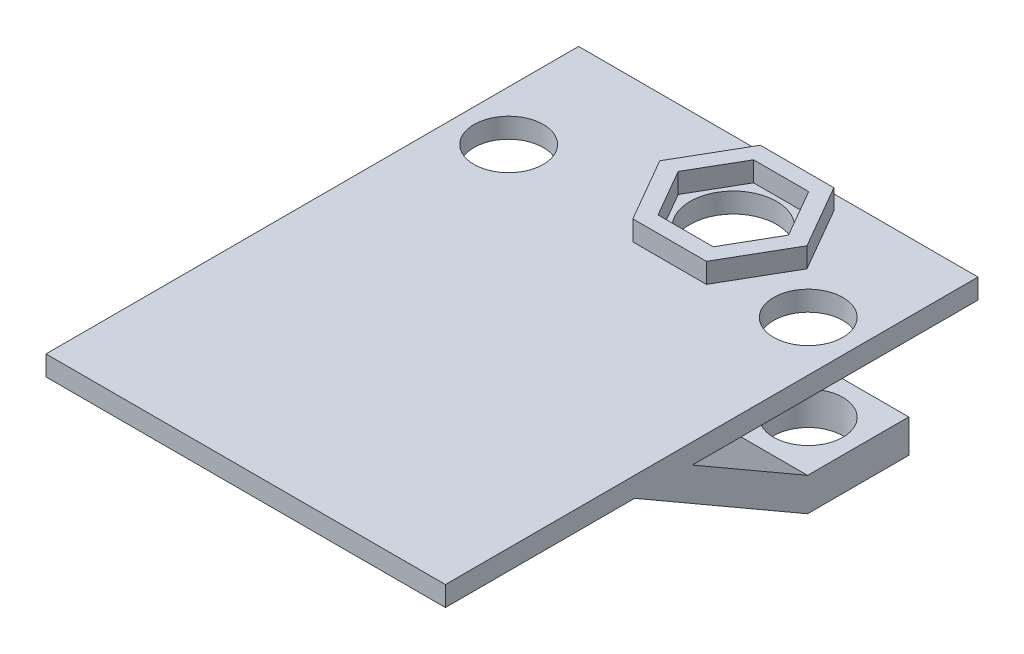
ISO-10303-21;
HEADER;
FILE_DESCRIPTION(('STEP AP214'),'2;1');
FILE_NAME('part.step','',(''),(''),'','','');
FILE_SCHEMA(('AUTOMOTIVE_DESIGN { 1 0 10303 214 1 1 1 1 }'));
ENDSEC;
DATA;
#1=APPLICATION_CONTEXT('core data for automotive mechanical design processes');
#2=APPLICATION_PROTOCOL_DEFINITION('international standard','automotive_design',2000,#1);
#3=PRODUCT_CONTEXT('',#1,'mechanical');
#4=PRODUCT('Part','Part','',(#3));
#5=PRODUCT_RELATED_PRODUCT_CATEGORY('part','',(#4));
#6=PRODUCT_DEFINITION_FORMATION('','',#4);
#7=PRODUCT_DEFINITION_CONTEXT('part definition',#1,'design');
#8=PRODUCT_DEFINITION('design','',#6,#7);
#9=PRODUCT_DEFINITION_SHAPE('','',#8);
#10=(LENGTH_UNIT() NAMED_UNIT(*) SI_UNIT(.MILLI.,.METRE.));
#11=(NAMED_UNIT(*) PLANE_ANGLE_UNIT() SI_UNIT($,.RADIAN.));
#12=(NAMED_UNIT(*) SI_UNIT($,.STERADIAN.) SOLID_ANGLE_UNIT());
#13=UNCERTAINTY_MEASURE_WITH_UNIT(LENGTH_MEASURE(1.E-05),#10,'distance_accuracy_value','');
#14=(GEOMETRIC_REPRESENTATION_CONTEXT(3) GLOBAL_UNCERTAINTY_ASSIGNED_CONTEXT((#13)) GLOBAL_UNIT_ASSIGNED_CONTEXT((#10,
#11,#12)) REPRESENTATION_CONTEXT('',''));
#15=CARTESIAN_POINT('',(0.,0.,0.));
#16=DIRECTION('',(0.,0.,1.));
#17=DIRECTION('',(1.,0.,0.));
#18=AXIS2_PLACEMENT_3D('',#15,#16,#17);
#19=CARTESIAN_POINT('',(0.,3.,0.));
#20=DIRECTION('',(0.,1.,0.));
#21=DIRECTION('',(0.,0.,1.));
#22=AXIS2_PLACEMENT_3D('',#19,#20,#21);
#23=PLANE('',#22);
#24=CARTESIAN_POINT('',(22.5,3.,-22.));
#25=DIRECTION('',(0.,1.,0.));
#26=DIRECTION('',(0.,0.,1.));
#27=AXIS2_PLACEMENT_3D('',#24,#25,#26);
#28=CIRCLE('',#27,5.2);
#29=CARTESIAN_POINT('',(22.5,3.,-16.8));
#30=VERTEX_POINT('',#29);
#31=EDGE_CURVE('E241',#30,#30,#28,.T.);
#32=ORIENTED_EDGE('',*,*,#31,.F.);
#33=EDGE_LOOP('',(#32));
#34=FACE_BOUND('',#33,.T.);
#35=CARTESIAN_POINT('',(-22.5,3.,-22.));
#36=DIRECTION('',(0.,1.,0.));
#37=DIRECTION('',(0.,0.,1.));
#38=AXIS2_PLACEMENT_3D('',#35,#36,#37);
#39=CIRCLE('',#38,5.2);
#40=CARTESIAN_POINT('',(-22.5,3.,-16.8));
#41=VERTEX_POINT('',#40);
#42=EDGE_CURVE('E912',#41,#41,#39,.T.);
#43=ORIENTED_EDGE('',*,*,#42,.F.);
#44=EDGE_LOOP('',(#43));
#45=FACE_BOUND('',#44,.T.);
#46=DIRECTION('',(-1.,0.,0.));
#47=VECTOR('',#46,1.);
#48=CARTESIAN_POINT('',(0.,3.,40.));
#49=LINE('',#48,#47);
#50=CARTESIAN_POINT('',(30.,3.,40.));
#51=VERTEX_POINT('',#50);
#52=CARTESIAN_POINT('',(-30.,3.,40.));
#53=VERTEX_POINT('',#52);
#54=EDGE_CURVE('E385',#51,#53,#49,.T.);
#55=ORIENTED_EDGE('',*,*,#54,.F.);
#56=DIRECTION('',(0.,0.,-1.));
#57=VECTOR('',#56,1.);
#58=CARTESIAN_POINT('',(30.,3.,0.));
#59=LINE('',#58,#57);
#60=CARTESIAN_POINT('',(30.,3.,-40.));
#61=VERTEX_POINT('',#60);
#62=EDGE_CURVE('E388',#51,#61,#59,.T.);
#63=ORIENTED_EDGE('',*,*,#62,.T.);
#64=DIRECTION('',(-1.,0.,0.));
#65=VECTOR('',#64,1.);
#66=CARTESIAN_POINT('',(0.,3.,-40.));
#67=LINE('',#66,#65);
#68=CARTESIAN_POINT('',(-30.,3.,-40.));
#69=VERTEX_POINT('',#68);
#70=EDGE_CURVE('E391',#61,#69,#67,.T.);
#71=ORIENTED_EDGE('',*,*,#70,.T.);
#72=DIRECTION('',(0.,0.,-1.));
#73=VECTOR('',#72,1.);
#74=CARTESIAN_POINT('',(-30.,3.,0.));
#75=LINE('',#74,#73);
#76=EDGE_CURVE('E393',#53,#69,#75,.T.);
#77=ORIENTED_EDGE('',*,*,#76,.F.);
#78=EDGE_LOOP('',(#55,#63,#71,#77));
#79=FACE_BOUND('',#78,.T.);
#80=DIRECTION('',(-1.,0.,0.));
#81=VECTOR('',#80,1.);
#82=CARTESIAN_POINT('',(0.,3.,-18.645));
#83=LINE('',#82,#81);
#84=CARTESIAN_POINT('',(10.5581288274906,3.,-18.645));
#85=VERTEX_POINT('',#84);
#86=CARTESIAN_POINT('',(-0.498128827490664,3.,-18.645));
#87=VERTEX_POINT('',#86);
#88=EDGE_CURVE('E435',#85,#87,#83,.T.);
#89=ORIENTED_EDGE('',*,*,#88,.T.);
#90=DIRECTION('',(-0.5,0.,-0.866025403784439));
#91=VECTOR('',#90,1.);
#92=CARTESIAN_POINT('',(7.69992520616244,3.,-4.44555389051787));
#93=LINE('',#92,#91);
#94=CARTESIAN_POINT('',(-6.02625765498133,3.,-28.22));
#95=VERTEX_POINT('',#94);
#96=EDGE_CURVE('E438',#87,#95,#93,.T.);
#97=ORIENTED_EDGE('',*,*,#96,.T.);
#98=DIRECTION('',(0.5,0.,-0.866025403784439));
#99=VECTOR('',#98,1.);
#100=CARTESIAN_POINT('',(-16.7393116886344,3.,-9.66444610948214));
#101=LINE('',#100,#99);
#102=CARTESIAN_POINT('',(-0.498128827490663,3.,-37.795));
#103=VERTEX_POINT('',#102);
#104=EDGE_CURVE('E423',#95,#103,#101,.T.);
#105=ORIENTED_EDGE('',*,*,#104,.T.);
#106=DIRECTION('',(1.,0.,0.));
#107=VECTOR('',#106,1.);
#108=CARTESIAN_POINT('',(0.,3.,-37.795));
#109=LINE('',#108,#107);
#110=CARTESIAN_POINT('',(10.5581288274907,3.,-37.795));
#111=VERTEX_POINT('',#110);
#112=EDGE_CURVE('E426',#103,#111,#109,.T.);
#113=ORIENTED_EDGE('',*,*,#112,.T.);
#114=DIRECTION('',(0.5,0.,0.866025403784439));
#115=VECTOR('',#114,1.);
#116=CARTESIAN_POINT('',(24.2843116886344,3.,-14.0205538905179));
#117=LINE('',#116,#115);
#118=CARTESIAN_POINT('',(16.0862576549813,3.,-28.22));
#119=VERTEX_POINT('',#118);
#120=EDGE_CURVE('E429',#111,#119,#117,.T.);
#121=ORIENTED_EDGE('',*,*,#120,.T.);
#122=DIRECTION('',(-0.5,0.,0.866025403784439));
#123=VECTOR('',#122,1.);
#124=CARTESIAN_POINT('',(-0.154925206162447,3.,-0.0894461094821473));
#125=LINE('',#124,#123);
#126=EDGE_CURVE('E432',#119,#85,#125,.T.);
#127=ORIENTED_EDGE('',*,*,#126,.T.);
#128=EDGE_LOOP('',(#89,#97,#105,#113,#121,#127));
#129=FACE_BOUND('',#128,.T.);
#130=ADVANCED_FACE('F38',(#34,#45,#79,#129),#23,.T.);
#131=CARTESIAN_POINT('',(0.,0.,0.));
#132=DIRECTION('',(0.,1.,0.));
#133=DIRECTION('',(0.,0.,1.));
#134=AXIS2_PLACEMENT_3D('',#131,#132,#133);
#135=PLANE('',#134);
#136=CARTESIAN_POINT('',(22.5,0.,-22.));
#137=DIRECTION('',(0.,1.,0.));
#138=DIRECTION('',(0.,0.,1.));
#139=AXIS2_PLACEMENT_3D('',#136,#137,#138);
#140=CIRCLE('',#139,5.2);
#141=CARTESIAN_POINT('',(22.5,0.,-16.8));
#142=VERTEX_POINT('',#141);
#143=EDGE_CURVE('E909',#142,#142,#140,.T.);
#144=ORIENTED_EDGE('',*,*,#143,.T.);
#145=EDGE_LOOP('',(#144));
#146=FACE_BOUND('',#145,.T.);
#147=CARTESIAN_POINT('',(-22.5,0.,-22.));
#148=DIRECTION('',(0.,1.,0.));
#149=DIRECTION('',(0.,0.,1.));
#150=AXIS2_PLACEMENT_3D('',#147,#148,#149);
#151=CIRCLE('',#150,5.2);
#152=CARTESIAN_POINT('',(-22.5,0.,-16.8));
#153=VERTEX_POINT('',#152);
#154=EDGE_CURVE('E916',#153,#153,#151,.T.);
#155=ORIENTED_EDGE('',*,*,#154,.T.);
#156=EDGE_LOOP('',(#155));
#157=FACE_BOUND('',#156,.T.);
#158=CARTESIAN_POINT('',(5.03,0.,-28.22));
#159=DIRECTION('',(0.,1.,0.));
#160=DIRECTION('',(0.,0.,1.));
#161=AXIS2_PLACEMENT_3D('',#158,#159,#160);
#162=CIRCLE('',#161,6.5);
#163=CARTESIAN_POINT('',(5.03,0.,-21.72));
#164=VERTEX_POINT('',#163);
#165=EDGE_CURVE('E389',#164,#164,#162,.T.);
#166=ORIENTED_EDGE('',*,*,#165,.T.);
#167=EDGE_LOOP('',(#166));
#168=FACE_BOUND('',#167,.T.);
#169=DIRECTION('',(-1.,0.,0.));
#170=VECTOR('',#169,1.);
#171=CARTESIAN_POINT('',(-15.,0.,2.92050807568872));
#172=LINE('',#171,#170);
#173=CARTESIAN_POINT('',(-15.,0.,2.92050807568873));
#174=VERTEX_POINT('',#173);
#175=CARTESIAN_POINT('',(-30.,0.,2.92050807568872));
#176=VERTEX_POINT('',#175);
#177=EDGE_CURVE('E337',#174,#176,#172,.T.);
#178=ORIENTED_EDGE('',*,*,#177,.T.);
#179=DIRECTION('',(0.,0.,-1.));
#180=VECTOR('',#179,1.);
#181=CARTESIAN_POINT('',(-30.,0.,0.));
#182=LINE('',#181,#180);
#183=CARTESIAN_POINT('',(-30.,0.,-40.));
#184=VERTEX_POINT('',#183);
#185=EDGE_CURVE('E409',#176,#184,#182,.T.);
#186=ORIENTED_EDGE('',*,*,#185,.T.);
#187=DIRECTION('',(-1.,0.,0.));
#188=VECTOR('',#187,1.);
#189=CARTESIAN_POINT('',(0.,0.,-40.));
#190=LINE('',#189,#188);
#191=CARTESIAN_POINT('',(30.,0.,-40.));
#192=VERTEX_POINT('',#191);
#193=EDGE_CURVE('E406',#192,#184,#190,.T.);
#194=ORIENTED_EDGE('',*,*,#193,.F.);
#195=DIRECTION('',(0.,0.,-1.));
#196=VECTOR('',#195,1.);
#197=CARTESIAN_POINT('',(30.,0.,0.));
#198=LINE('',#197,#196);
#199=CARTESIAN_POINT('',(30.,0.,2.92050807568873));
#200=VERTEX_POINT('',#199);
#201=EDGE_CURVE('E402',#200,#192,#198,.T.);
#202=ORIENTED_EDGE('',*,*,#201,.F.);
#203=DIRECTION('',(1.,0.,0.));
#204=VECTOR('',#203,1.);
#205=CARTESIAN_POINT('',(15.,0.,2.92050807568873));
#206=LINE('',#205,#204);
#207=CARTESIAN_POINT('',(15.,0.,2.92050807568873));
#208=VERTEX_POINT('',#207);
#209=EDGE_CURVE('E376',#208,#200,#206,.T.);
#210=ORIENTED_EDGE('',*,*,#209,.F.);
#211=DIRECTION('',(0.,0.,-1.));
#212=VECTOR('',#211,1.);
#213=CARTESIAN_POINT('',(15.,0.,0.));
#214=LINE('',#213,#212);
#215=CARTESIAN_POINT('',(15.,0.,11.5807621135331));
#216=VERTEX_POINT('',#215);
#217=EDGE_CURVE('E350',#216,#208,#214,.T.);
#218=ORIENTED_EDGE('',*,*,#217,.F.);
#219=DIRECTION('',(1.,0.,0.));
#220=VECTOR('',#219,1.);
#221=CARTESIAN_POINT('',(15.,0.,11.5807621135331));
#222=LINE('',#221,#220);
#223=CARTESIAN_POINT('',(30.,0.,11.5807621135331));
#224=VERTEX_POINT('',#223);
#225=EDGE_CURVE('E378',#216,#224,#222,.T.);
#226=ORIENTED_EDGE('',*,*,#225,.T.);
#227=CARTESIAN_POINT('',(30.,0.,40.));
#228=VERTEX_POINT('',#227);
#229=EDGE_CURVE('E403',#228,#224,#198,.T.);
#230=ORIENTED_EDGE('',*,*,#229,.F.);
#231=DIRECTION('',(-1.,0.,0.));
#232=VECTOR('',#231,1.);
#233=CARTESIAN_POINT('',(0.,0.,40.));
#234=LINE('',#233,#232);
#235=CARTESIAN_POINT('',(-30.,0.,40.));
#236=VERTEX_POINT('',#235);
#237=EDGE_CURVE('E384',#228,#236,#234,.T.);
#238=ORIENTED_EDGE('',*,*,#237,.T.);
#239=CARTESIAN_POINT('',(-30.,0.,11.5807621135331));
#240=VERTEX_POINT('',#239);
#241=EDGE_CURVE('E410',#236,#240,#182,.T.);
#242=ORIENTED_EDGE('',*,*,#241,.T.);
#243=DIRECTION('',(-1.,0.,0.));
#244=VECTOR('',#243,1.);
#245=CARTESIAN_POINT('',(-15.,0.,11.5807621135331));
#246=LINE('',#245,#244);
#247=CARTESIAN_POINT('',(-15.,0.,11.5807621135331));
#248=VERTEX_POINT('',#247);
#249=EDGE_CURVE('E334',#248,#240,#246,.T.);
#250=ORIENTED_EDGE('',*,*,#249,.F.);
#251=DIRECTION('',(0.,0.,1.));
#252=VECTOR('',#251,1.);
#253=CARTESIAN_POINT('',(-15.,0.,0.));
#254=LINE('',#253,#252);
#255=EDGE_CURVE('E306',#174,#248,#254,.T.);
#256=ORIENTED_EDGE('',*,*,#255,.F.);
#257=EDGE_LOOP('',(#178,#186,#194,#202,#210,#218,#226,#230,#238,#242,#250,#256));
#258=FACE_BOUND('',#257,.T.);
#259=ADVANCED_FACE('F474',(#146,#157,#168,#258),#135,.F.);
#260=CARTESIAN_POINT('',(0.,3.,40.));
#261=DIRECTION('',(0.,0.,1.));
#262=DIRECTION('',(1.,0.,0.));
#263=AXIS2_PLACEMENT_3D('',#260,#261,#262);
#264=PLANE('',#263);
#265=ORIENTED_EDGE('',*,*,#237,.F.);
#266=DIRECTION('',(0.,-1.,0.));
#267=VECTOR('',#266,1.);
#268=CARTESIAN_POINT('',(30.,3.,40.));
#269=LINE('',#268,#267);
#270=EDGE_CURVE('E421',#51,#228,#269,.T.);
#271=ORIENTED_EDGE('',*,*,#270,.F.);
#272=ORIENTED_EDGE('',*,*,#54,.T.);
#273=DIRECTION('',(0.,-1.,0.));
#274=VECTOR('',#273,1.);
#275=CARTESIAN_POINT('',(-30.,3.,40.));
#276=LINE('',#275,#274);
#277=EDGE_CURVE('E399',#53,#236,#276,.T.);
#278=ORIENTED_EDGE('',*,*,#277,.T.);
#279=EDGE_LOOP('',(#265,#271,#272,#278));
#280=FACE_BOUND('',#279,.T.);
#281=ADVANCED_FACE('F40',(#280),#264,.T.);
#282=CARTESIAN_POINT('',(30.,3.,0.));
#283=DIRECTION('',(-1.,0.,0.));
#284=DIRECTION('',(0.,0.,1.));
#285=AXIS2_PLACEMENT_3D('',#282,#283,#284);
#286=PLANE('',#285);
#287=ORIENTED_EDGE('',*,*,#229,.T.);
#288=DIRECTION('',(0.,0.500000000000001,0.866025403784438));
#289=VECTOR('',#288,1.);
#290=CARTESIAN_POINT('',(30.,-4.26461709275202,4.19422863405994));
#291=LINE('',#290,#289);
#292=CARTESIAN_POINT('',(30.,-15.,-14.4));
#293=VERTEX_POINT('',#292);
#294=EDGE_CURVE('E361',#293,#224,#291,.T.);
#295=ORIENTED_EDGE('',*,*,#294,.F.);
#296=DIRECTION('',(0.,0.,1.));
#297=VECTOR('',#296,1.);
#298=CARTESIAN_POINT('',(30.,-15.,0.));
#299=LINE('',#298,#297);
#300=CARTESIAN_POINT('',(30.,-15.,-29.6));
#301=VERTEX_POINT('',#300);
#302=EDGE_CURVE('E343',#301,#293,#299,.T.);
#303=ORIENTED_EDGE('',*,*,#302,.F.);
#304=DIRECTION('',(0.,-1.,0.));
#305=VECTOR('',#304,1.);
#306=CARTESIAN_POINT('',(30.,3.,-29.6));
#307=LINE('',#306,#305);
#308=CARTESIAN_POINT('',(30.,-10.,-29.6));
#309=VERTEX_POINT('',#308);
#310=EDGE_CURVE('E348',#309,#301,#307,.T.);
#311=ORIENTED_EDGE('',*,*,#310,.F.);
#312=DIRECTION('',(0.,0.,-1.));
#313=VECTOR('',#312,1.);
#314=CARTESIAN_POINT('',(30.,-10.,0.));
#315=LINE('',#314,#313);
#316=CARTESIAN_POINT('',(30.,-10.,-14.4));
#317=VERTEX_POINT('',#316);
#318=EDGE_CURVE('E365',#317,#309,#315,.T.);
#319=ORIENTED_EDGE('',*,*,#318,.F.);
#320=DIRECTION('',(0.,-0.500000000000001,-0.866025403784438));
#321=VECTOR('',#320,1.);
#322=CARTESIAN_POINT('',(30.,-0.514617092752021,2.02916512459884));
#323=LINE('',#322,#321);
#324=EDGE_CURVE('E363',#200,#317,#323,.T.);
#325=ORIENTED_EDGE('',*,*,#324,.F.);
#326=ORIENTED_EDGE('',*,*,#201,.T.);
#327=DIRECTION('',(0.,-1.,0.));
#328=VECTOR('',#327,1.);
#329=CARTESIAN_POINT('',(30.,3.,-40.));
#330=LINE('',#329,#328);
#331=EDGE_CURVE('E418',#61,#192,#330,.T.);
#332=ORIENTED_EDGE('',*,*,#331,.F.);
#333=ORIENTED_EDGE('',*,*,#62,.F.);
#334=ORIENTED_EDGE('',*,*,#270,.T.);
#335=EDGE_LOOP('',(#287,#295,#303,#311,#319,#325,#326,#332,#333,#334));
#336=FACE_BOUND('',#335,.T.);
#337=ADVANCED_FACE('F499',(#336),#286,.F.);
#338=CARTESIAN_POINT('',(0.,3.,-40.));
#339=DIRECTION('',(0.,0.,1.));
#340=DIRECTION('',(1.,0.,0.));
#341=AXIS2_PLACEMENT_3D('',#338,#339,#340);
#342=PLANE('',#341);
#343=ORIENTED_EDGE('',*,*,#193,.T.);
#344=DIRECTION('',(0.,-1.,0.));
#345=VECTOR('',#344,1.);
#346=CARTESIAN_POINT('',(-30.,3.,-40.));
#347=LINE('',#346,#345);
#348=EDGE_CURVE('E415',#69,#184,#347,.T.);
#349=ORIENTED_EDGE('',*,*,#348,.F.);
#350=ORIENTED_EDGE('',*,*,#70,.F.);
#351=ORIENTED_EDGE('',*,*,#331,.T.);
#352=EDGE_LOOP('',(#343,#349,#350,#351));
#353=FACE_BOUND('',#352,.T.);
#354=ADVANCED_FACE('F492',(#353),#342,.F.);
#355=CARTESIAN_POINT('',(-30.,3.,0.));
#356=DIRECTION('',(-1.,0.,0.));
#357=DIRECTION('',(0.,0.,1.));
#358=AXIS2_PLACEMENT_3D('',#355,#356,#357);
#359=PLANE('',#358);
#360=ORIENTED_EDGE('',*,*,#241,.F.);
#361=ORIENTED_EDGE('',*,*,#277,.F.);
#362=ORIENTED_EDGE('',*,*,#76,.T.);
#363=ORIENTED_EDGE('',*,*,#348,.T.);
#364=ORIENTED_EDGE('',*,*,#185,.F.);
#365=DIRECTION('',(0.,0.500000000000001,0.866025403784438));
#366=VECTOR('',#365,1.);
#367=CARTESIAN_POINT('',(-30.,-0.514617092752021,2.02916512459884));
#368=LINE('',#367,#366);
#369=CARTESIAN_POINT('',(-30.,-10.,-14.4));
#370=VERTEX_POINT('',#369);
#371=EDGE_CURVE('E318',#370,#176,#368,.T.);
#372=ORIENTED_EDGE('',*,*,#371,.F.);
#373=DIRECTION('',(0.,0.,1.));
#374=VECTOR('',#373,1.);
#375=CARTESIAN_POINT('',(-30.,-10.,0.));
#376=LINE('',#375,#374);
#377=CARTESIAN_POINT('',(-30.,-10.,-29.6));
#378=VERTEX_POINT('',#377);
#379=EDGE_CURVE('E287',#378,#370,#376,.T.);
#380=ORIENTED_EDGE('',*,*,#379,.F.);
#381=DIRECTION('',(0.,1.,0.));
#382=VECTOR('',#381,1.);
#383=CARTESIAN_POINT('',(-30.,3.,-29.6));
#384=LINE('',#383,#382);
#385=CARTESIAN_POINT('',(-30.,-15.,-29.6));
#386=VERTEX_POINT('',#385);
#387=EDGE_CURVE('E303',#386,#378,#384,.T.);
#388=ORIENTED_EDGE('',*,*,#387,.F.);
#389=DIRECTION('',(0.,0.,-1.));
#390=VECTOR('',#389,1.);
#391=CARTESIAN_POINT('',(-30.,-15.,0.));
#392=LINE('',#391,#390);
#393=CARTESIAN_POINT('',(-30.,-15.,-14.4));
#394=VERTEX_POINT('',#393);
#395=EDGE_CURVE('E323',#394,#386,#392,.T.);
#396=ORIENTED_EDGE('',*,*,#395,.F.);
#397=DIRECTION('',(0.,-0.500000000000001,-0.866025403784438));
#398=VECTOR('',#397,1.);
#399=CARTESIAN_POINT('',(-30.,-4.26461709275202,4.19422863405994));
#400=LINE('',#399,#398);
#401=EDGE_CURVE('E321',#240,#394,#400,.T.);
#402=ORIENTED_EDGE('',*,*,#401,.F.);
#403=EDGE_LOOP('',(#360,#361,#362,#363,#364,#372,#380,#388,#396,#402));
#404=FACE_BOUND('',#403,.T.);
#405=ADVANCED_FACE('F470',(#404),#359,.T.);
#406=CARTESIAN_POINT('',(5.03,3.,-28.22));
#407=DIRECTION('',(0.,-1.,0.));
#408=DIRECTION('',(0.,0.,-1.));
#409=AXIS2_PLACEMENT_3D('',#406,#407,#408);
#410=CYLINDRICAL_SURFACE('',#409,6.5);
#411=CARTESIAN_POINT('',(5.03,3.,-28.22));
#412=DIRECTION('',(0.,1.,0.));
#413=DIRECTION('',(0.,0.,1.));
#414=AXIS2_PLACEMENT_3D('',#411,#412,#413);
#415=CIRCLE('',#414,6.5);
#416=CARTESIAN_POINT('',(5.03,3.,-21.72));
#417=VERTEX_POINT('',#416);
#418=EDGE_CURVE('E396',#417,#417,#415,.T.);
#419=ORIENTED_EDGE('',*,*,#418,.T.);
#420=EDGE_LOOP('',(#419));
#421=FACE_BOUND('',#420,.T.);
#422=ORIENTED_EDGE('',*,*,#165,.F.);
#423=EDGE_LOOP('',(#422));
#424=FACE_BOUND('',#423,.T.);
#425=ADVANCED_FACE('F464',(#421,#424),#410,.F.);
#426=DIRECTION('',(1.,0.,0.));
#427=VECTOR('',#426,1.);
#428=CARTESIAN_POINT('',(0.,3.,-35.395));
#429=LINE('',#428,#427);
#430=CARTESIAN_POINT('',(0.887511818564434,3.,-35.395));
#431=VERTEX_POINT('',#430);
#432=CARTESIAN_POINT('',(9.17248818143556,3.,-35.395));
#433=VERTEX_POINT('',#432);
#434=EDGE_CURVE('E11',#431,#433,#429,.T.);
#435=ORIENTED_EDGE('',*,*,#434,.F.);
#436=DIRECTION('',(0.5,0.,-0.866025403784439));
#437=VECTOR('',#436,1.);
#438=CARTESIAN_POINT('',(-14.6608507195518,3.,-8.46444610948214));
#439=LINE('',#438,#437);
#440=CARTESIAN_POINT('',(-3.25497636287113,3.,-28.22));
#441=VERTEX_POINT('',#440);
#442=EDGE_CURVE('E441',#441,#431,#439,.T.);
#443=ORIENTED_EDGE('',*,*,#442,.F.);
#444=DIRECTION('',(-0.5,0.,-0.866025403784439));
#445=VECTOR('',#444,1.);
#446=CARTESIAN_POINT('',(9.77838617524508,3.,-5.64555389051786));
#447=LINE('',#446,#445);
#448=CARTESIAN_POINT('',(0.887511818564429,3.,-21.045));
#449=VERTEX_POINT('',#448);
#450=EDGE_CURVE('E444',#449,#441,#447,.T.);
#451=ORIENTED_EDGE('',*,*,#450,.F.);
#452=DIRECTION('',(-1.,0.,0.));
#453=VECTOR('',#452,1.);
#454=CARTESIAN_POINT('',(0.,3.,-21.045));
#455=LINE('',#454,#453);
#456=CARTESIAN_POINT('',(9.17248818143555,3.,-21.045));
#457=VERTEX_POINT('',#456);
#458=EDGE_CURVE('E447',#457,#449,#455,.T.);
#459=ORIENTED_EDGE('',*,*,#458,.F.);
#460=DIRECTION('',(-0.5,0.,0.866025403784439));
#461=VECTOR('',#460,1.);
#462=CARTESIAN_POINT('',(-2.2333861752451,3.,-1.28944610948215));
#463=LINE('',#462,#461);
#464=CARTESIAN_POINT('',(13.3149763628711,3.,-28.22));
#465=VERTEX_POINT('',#464);
#466=EDGE_CURVE('E57',#465,#457,#463,.T.);
#467=ORIENTED_EDGE('',*,*,#466,.F.);
#468=DIRECTION('',(0.5,0.,0.866025403784439));
#469=VECTOR('',#468,1.);
#470=CARTESIAN_POINT('',(22.2058507195518,3.,-12.8205538905179));
#471=LINE('',#470,#469);
#472=EDGE_CURVE('E47',#433,#465,#471,.T.);
#473=ORIENTED_EDGE('',*,*,#472,.F.);
#474=EDGE_LOOP('',(#435,#443,#451,#459,#467,#473));
#475=FACE_BOUND('',#474,.T.);
#476=ORIENTED_EDGE('',*,*,#418,.F.);
#477=EDGE_LOOP('',(#476));
#478=FACE_BOUND('',#477,.T.);
#479=ADVANCED_FACE('F460',(#475,#478),#23,.T.);
#480=CARTESIAN_POINT('',(15.,-15.,0.));
#481=DIRECTION('',(0.,1.,0.));
#482=DIRECTION('',(0.,0.,1.));
#483=AXIS2_PLACEMENT_3D('',#480,#481,#482);
#484=PLANE('',#483);
#485=CARTESIAN_POINT('',(22.5,-15.,-22.));
#486=DIRECTION('',(0.,1.,0.));
#487=DIRECTION('',(0.,0.,1.));
#488=AXIS2_PLACEMENT_3D('',#485,#486,#487);
#489=CIRCLE('',#488,5.2);
#490=CARTESIAN_POINT('',(22.5,-15.,-16.8));
#491=VERTEX_POINT('',#490);
#492=EDGE_CURVE('E922',#491,#491,#489,.T.);
#493=ORIENTED_EDGE('',*,*,#492,.T.);
#494=EDGE_LOOP('',(#493));
#495=FACE_BOUND('',#494,.T.);
#496=ORIENTED_EDGE('',*,*,#302,.T.);
#497=DIRECTION('',(1.,0.,0.));
#498=VECTOR('',#497,1.);
#499=CARTESIAN_POINT('',(15.,-15.,-14.4));
#500=LINE('',#499,#498);
#501=CARTESIAN_POINT('',(15.,-15.,-14.4));
#502=VERTEX_POINT('',#501);
#503=EDGE_CURVE('E381',#502,#293,#500,.T.);
#504=ORIENTED_EDGE('',*,*,#503,.F.);
#505=DIRECTION('',(0.,0.,1.));
#506=VECTOR('',#505,1.);
#507=CARTESIAN_POINT('',(15.,-15.,0.));
#508=LINE('',#507,#506);
#509=CARTESIAN_POINT('',(15.,-15.,-29.6));
#510=VERTEX_POINT('',#509);
#511=EDGE_CURVE('E344',#510,#502,#508,.T.);
#512=ORIENTED_EDGE('',*,*,#511,.F.);
#513=DIRECTION('',(1.,0.,0.));
#514=VECTOR('',#513,1.);
#515=CARTESIAN_POINT('',(15.,-15.,-29.6));
#516=LINE('',#515,#514);
#517=EDGE_CURVE('E358',#510,#301,#516,.T.);
#518=ORIENTED_EDGE('',*,*,#517,.T.);
#519=EDGE_LOOP('',(#496,#504,#512,#518));
#520=FACE_BOUND('',#519,.T.);
#521=ADVANCED_FACE('F463',(#495,#520),#484,.F.);
#522=CARTESIAN_POINT('',(15.,-4.26461709275202,4.19422863405994));
#523=DIRECTION('',(0.,0.866025403784438,-0.500000000000001));
#524=DIRECTION('',(0.,0.500000000000001,0.866025403784438));
#525=AXIS2_PLACEMENT_3D('',#522,#523,#524);
#526=PLANE('',#525);
#527=ORIENTED_EDGE('',*,*,#294,.T.);
#528=ORIENTED_EDGE('',*,*,#225,.F.);
#529=DIRECTION('',(0.,0.500000000000001,0.866025403784438));
#530=VECTOR('',#529,1.);
#531=CARTESIAN_POINT('',(15.,-4.26461709275202,4.19422863405994));
#532=LINE('',#531,#530);
#533=EDGE_CURVE('E347',#502,#216,#532,.T.);
#534=ORIENTED_EDGE('',*,*,#533,.F.);
#535=ORIENTED_EDGE('',*,*,#503,.T.);
#536=EDGE_LOOP('',(#527,#528,#534,#535));
#537=FACE_BOUND('',#536,.T.);
#538=ADVANCED_FACE('F588',(#537),#526,.F.);
#539=CARTESIAN_POINT('',(15.,-0.514617092752021,2.02916512459884));
#540=DIRECTION('',(0.,-0.866025403784438,0.500000000000001));
#541=DIRECTION('',(0.,-0.500000000000001,-0.866025403784438));
#542=AXIS2_PLACEMENT_3D('',#539,#540,#541);
#543=PLANE('',#542);
#544=ORIENTED_EDGE('',*,*,#324,.T.);
#545=DIRECTION('',(1.,0.,0.));
#546=VECTOR('',#545,1.);
#547=CARTESIAN_POINT('',(15.,-10.,-14.4));
#548=LINE('',#547,#546);
#549=CARTESIAN_POINT('',(15.,-10.,-14.4));
#550=VERTEX_POINT('',#549);
#551=EDGE_CURVE('E373',#550,#317,#548,.T.);
#552=ORIENTED_EDGE('',*,*,#551,.F.);
#553=DIRECTION('',(0.,-0.500000000000001,-0.866025403784438));
#554=VECTOR('',#553,1.);
#555=CARTESIAN_POINT('',(15.,-0.514617092752021,2.02916512459884));
#556=LINE('',#555,#554);
#557=EDGE_CURVE('E352',#208,#550,#556,.T.);
#558=ORIENTED_EDGE('',*,*,#557,.F.);
#559=ORIENTED_EDGE('',*,*,#209,.T.);
#560=EDGE_LOOP('',(#544,#552,#558,#559));
#561=FACE_BOUND('',#560,.T.);
#562=ADVANCED_FACE('F505',(#561),#543,.F.);
#563=CARTESIAN_POINT('',(15.,-10.,0.));
#564=DIRECTION('',(0.,-1.,0.));
#565=DIRECTION('',(0.,0.,-1.));
#566=AXIS2_PLACEMENT_3D('',#563,#564,#565);
#567=PLANE('',#566);
#568=CARTESIAN_POINT('',(22.5,-10.,-22.));
#569=DIRECTION('',(0.,-1.,0.));
#570=DIRECTION('',(0.,0.,-1.));
#571=AXIS2_PLACEMENT_3D('',#568,#569,#570);
#572=CIRCLE('',#571,5.2);
#573=CARTESIAN_POINT('',(22.5,-10.,-27.2));
#574=VERTEX_POINT('',#573);
#575=EDGE_CURVE('E42',#574,#574,#572,.T.);
#576=ORIENTED_EDGE('',*,*,#575,.T.);
#577=EDGE_LOOP('',(#576));
#578=FACE_BOUND('',#577,.T.);
#579=ORIENTED_EDGE('',*,*,#318,.T.);
#580=DIRECTION('',(1.,0.,0.));
#581=VECTOR('',#580,1.);
#582=CARTESIAN_POINT('',(15.,-10.,-29.6));
#583=LINE('',#582,#581);
#584=CARTESIAN_POINT('',(15.,-10.,-29.6));
#585=VERTEX_POINT('',#584);
#586=EDGE_CURVE('E370',#585,#309,#583,.T.);
#587=ORIENTED_EDGE('',*,*,#586,.F.);
#588=DIRECTION('',(0.,0.,-1.));
#589=VECTOR('',#588,1.);
#590=CARTESIAN_POINT('',(15.,-10.,0.));
#591=LINE('',#590,#589);
#592=EDGE_CURVE('E354',#550,#585,#591,.T.);
#593=ORIENTED_EDGE('',*,*,#592,.F.);
#594=ORIENTED_EDGE('',*,*,#551,.T.);
#595=EDGE_LOOP('',(#579,#587,#593,#594));
#596=FACE_BOUND('',#595,.T.);
#597=ADVANCED_FACE('F509',(#578,#596),#567,.F.);
#598=CARTESIAN_POINT('',(15.,3.,-29.6));
#599=DIRECTION('',(0.,0.,1.));
#600=DIRECTION('',(1.,0.,0.));
#601=AXIS2_PLACEMENT_3D('',#598,#599,#600);
#602=PLANE('',#601);
#603=ORIENTED_EDGE('',*,*,#310,.T.);
#604=ORIENTED_EDGE('',*,*,#517,.F.);
#605=DIRECTION('',(0.,-1.,0.));
#606=VECTOR('',#605,1.);
#607=CARTESIAN_POINT('',(15.,3.,-29.6));
#608=LINE('',#607,#606);
#609=EDGE_CURVE('E356',#585,#510,#608,.T.);
#610=ORIENTED_EDGE('',*,*,#609,.F.);
#611=ORIENTED_EDGE('',*,*,#586,.T.);
#612=EDGE_LOOP('',(#603,#604,#610,#611));
#613=FACE_BOUND('',#612,.T.);
#614=ADVANCED_FACE('F600',(#613),#602,.F.);
#615=CARTESIAN_POINT('',(15.,0.,0.));
#616=DIRECTION('',(1.,0.,0.));
#617=DIRECTION('',(0.,0.,-1.));
#618=AXIS2_PLACEMENT_3D('',#615,#616,#617);
#619=PLANE('',#618);
#620=ORIENTED_EDGE('',*,*,#511,.T.);
#621=ORIENTED_EDGE('',*,*,#533,.T.);
#622=ORIENTED_EDGE('',*,*,#217,.T.);
#623=ORIENTED_EDGE('',*,*,#557,.T.);
#624=ORIENTED_EDGE('',*,*,#592,.T.);
#625=ORIENTED_EDGE('',*,*,#609,.T.);
#626=EDGE_LOOP('',(#620,#621,#622,#623,#624,#625));
#627=FACE_BOUND('',#626,.T.);
#628=ADVANCED_FACE('F513',(#627),#619,.F.);
#629=CARTESIAN_POINT('',(-15.,-10.,0.));
#630=DIRECTION('',(0.,-1.,0.));
#631=DIRECTION('',(0.,0.,-1.));
#632=AXIS2_PLACEMENT_3D('',#629,#630,#631);
#633=PLANE('',#632);
#634=CARTESIAN_POINT('',(-22.5,-10.,-22.));
#635=DIRECTION('',(0.,-1.,0.));
#636=DIRECTION('',(0.,0.,-1.));
#637=AXIS2_PLACEMENT_3D('',#634,#635,#636);
#638=CIRCLE('',#637,5.2);
#639=CARTESIAN_POINT('',(-22.5,-10.,-27.2));
#640=VERTEX_POINT('',#639);
#641=EDGE_CURVE('E919',#640,#640,#638,.T.);
#642=ORIENTED_EDGE('',*,*,#641,.T.);
#643=EDGE_LOOP('',(#642));
#644=FACE_BOUND('',#643,.T.);
#645=ORIENTED_EDGE('',*,*,#379,.T.);
#646=DIRECTION('',(-1.,0.,0.));
#647=VECTOR('',#646,1.);
#648=CARTESIAN_POINT('',(-15.,-10.,-14.4));
#649=LINE('',#648,#647);
#650=CARTESIAN_POINT('',(-15.,-10.,-14.4));
#651=VERTEX_POINT('',#650);
#652=EDGE_CURVE('E340',#651,#370,#649,.T.);
#653=ORIENTED_EDGE('',*,*,#652,.F.);
#654=DIRECTION('',(0.,0.,1.));
#655=VECTOR('',#654,1.);
#656=CARTESIAN_POINT('',(-15.,-10.,0.));
#657=LINE('',#656,#655);
#658=CARTESIAN_POINT('',(-15.,-10.,-29.6));
#659=VERTEX_POINT('',#658);
#660=EDGE_CURVE('E299',#659,#651,#657,.T.);
#661=ORIENTED_EDGE('',*,*,#660,.F.);
#662=DIRECTION('',(-1.,0.,0.));
#663=VECTOR('',#662,1.);
#664=CARTESIAN_POINT('',(-15.,-10.,-29.6));
#665=LINE('',#664,#663);
#666=EDGE_CURVE('E315',#659,#378,#665,.T.);
#667=ORIENTED_EDGE('',*,*,#666,.T.);
#668=EDGE_LOOP('',(#645,#653,#661,#667));
#669=FACE_BOUND('',#668,.T.);
#670=ADVANCED_FACE('F538',(#644,#669),#633,.F.);
#671=CARTESIAN_POINT('',(-15.,-0.514617092752021,2.02916512459884));
#672=DIRECTION('',(0.,-0.866025403784438,0.500000000000001));
#673=DIRECTION('',(0.,-0.500000000000001,-0.866025403784438));
#674=AXIS2_PLACEMENT_3D('',#671,#672,#673);
#675=PLANE('',#674);
#676=ORIENTED_EDGE('',*,*,#371,.T.);
#677=ORIENTED_EDGE('',*,*,#177,.F.);
#678=DIRECTION('',(0.,0.500000000000001,0.866025403784438));
#679=VECTOR('',#678,1.);
#680=CARTESIAN_POINT('',(-15.,-0.514617092752021,2.02916512459884));
#681=LINE('',#680,#679);
#682=EDGE_CURVE('E302',#651,#174,#681,.T.);
#683=ORIENTED_EDGE('',*,*,#682,.F.);
#684=ORIENTED_EDGE('',*,*,#652,.T.);
#685=EDGE_LOOP('',(#676,#677,#683,#684));
#686=FACE_BOUND('',#685,.T.);
#687=ADVANCED_FACE('F482',(#686),#675,.F.);
#688=CARTESIAN_POINT('',(-15.,-4.26461709275202,4.19422863405994));
#689=DIRECTION('',(0.,0.866025403784438,-0.500000000000001));
#690=DIRECTION('',(0.,0.500000000000001,0.866025403784438));
#691=AXIS2_PLACEMENT_3D('',#688,#689,#690);
#692=PLANE('',#691);
#693=ORIENTED_EDGE('',*,*,#401,.T.);
#694=DIRECTION('',(-1.,0.,0.));
#695=VECTOR('',#694,1.);
#696=CARTESIAN_POINT('',(-15.,-15.,-14.4));
#697=LINE('',#696,#695);
#698=CARTESIAN_POINT('',(-15.,-15.,-14.4));
#699=VERTEX_POINT('',#698);
#700=EDGE_CURVE('E331',#699,#394,#697,.T.);
#701=ORIENTED_EDGE('',*,*,#700,.F.);
#702=DIRECTION('',(0.,-0.500000000000001,-0.866025403784438));
#703=VECTOR('',#702,1.);
#704=CARTESIAN_POINT('',(-15.,-4.26461709275202,4.19422863405994));
#705=LINE('',#704,#703);
#706=EDGE_CURVE('E309',#248,#699,#705,.T.);
#707=ORIENTED_EDGE('',*,*,#706,.F.);
#708=ORIENTED_EDGE('',*,*,#249,.T.);
#709=EDGE_LOOP('',(#693,#701,#707,#708));
#710=FACE_BOUND('',#709,.T.);
#711=ADVANCED_FACE('F526',(#710),#692,.F.);
#712=CARTESIAN_POINT('',(-15.,-15.,0.));
#713=DIRECTION('',(0.,1.,0.));
#714=DIRECTION('',(0.,0.,1.));
#715=AXIS2_PLACEMENT_3D('',#712,#713,#714);
#716=PLANE('',#715);
#717=CARTESIAN_POINT('',(-22.5,-15.,-22.));
#718=DIRECTION('',(0.,1.,0.));
#719=DIRECTION('',(0.,0.,1.));
#720=AXIS2_PLACEMENT_3D('',#717,#718,#719);
#721=CIRCLE('',#720,5.2);
#722=CARTESIAN_POINT('',(-22.5,-15.,-16.8));
#723=VERTEX_POINT('',#722);
#724=EDGE_CURVE('E923',#723,#723,#721,.T.);
#725=ORIENTED_EDGE('',*,*,#724,.T.);
#726=EDGE_LOOP('',(#725));
#727=FACE_BOUND('',#726,.T.);
#728=ORIENTED_EDGE('',*,*,#395,.T.);
#729=DIRECTION('',(-1.,0.,0.));
#730=VECTOR('',#729,1.);
#731=CARTESIAN_POINT('',(-15.,-15.,-29.6));
#732=LINE('',#731,#730);
#733=CARTESIAN_POINT('',(-15.,-15.,-29.6));
#734=VERTEX_POINT('',#733);
#735=EDGE_CURVE('E328',#734,#386,#732,.T.);
#736=ORIENTED_EDGE('',*,*,#735,.F.);
#737=DIRECTION('',(0.,0.,-1.));
#738=VECTOR('',#737,1.);
#739=CARTESIAN_POINT('',(-15.,-15.,0.));
#740=LINE('',#739,#738);
#741=EDGE_CURVE('E311',#699,#734,#740,.T.);
#742=ORIENTED_EDGE('',*,*,#741,.F.);
#743=ORIENTED_EDGE('',*,*,#700,.T.);
#744=EDGE_LOOP('',(#728,#736,#742,#743));
#745=FACE_BOUND('',#744,.T.);
#746=ADVANCED_FACE('F530',(#727,#745),#716,.F.);
#747=CARTESIAN_POINT('',(-15.,3.,-29.6));
#748=DIRECTION('',(0.,0.,1.));
#749=DIRECTION('',(1.,0.,0.));
#750=AXIS2_PLACEMENT_3D('',#747,#748,#749);
#751=PLANE('',#750);
#752=ORIENTED_EDGE('',*,*,#387,.T.);
#753=ORIENTED_EDGE('',*,*,#666,.F.);
#754=DIRECTION('',(0.,1.,0.));
#755=VECTOR('',#754,1.);
#756=CARTESIAN_POINT('',(-15.,3.,-29.6));
#757=LINE('',#756,#755);
#758=EDGE_CURVE('E313',#734,#659,#757,.T.);
#759=ORIENTED_EDGE('',*,*,#758,.F.);
#760=ORIENTED_EDGE('',*,*,#735,.T.);
#761=EDGE_LOOP('',(#752,#753,#759,#760));
#762=FACE_BOUND('',#761,.T.);
#763=ADVANCED_FACE('F540',(#762),#751,.F.);
#764=CARTESIAN_POINT('',(-15.,0.,0.));
#765=DIRECTION('',(-1.,0.,0.));
#766=DIRECTION('',(0.,0.,1.));
#767=AXIS2_PLACEMENT_3D('',#764,#765,#766);
#768=PLANE('',#767);
#769=ORIENTED_EDGE('',*,*,#660,.T.);
#770=ORIENTED_EDGE('',*,*,#682,.T.);
#771=ORIENTED_EDGE('',*,*,#255,.T.);
#772=ORIENTED_EDGE('',*,*,#706,.T.);
#773=ORIENTED_EDGE('',*,*,#741,.T.);
#774=ORIENTED_EDGE('',*,*,#758,.T.);
#775=EDGE_LOOP('',(#769,#770,#771,#772,#773,#774));
#776=FACE_BOUND('',#775,.T.);
#777=ADVANCED_FACE('F534',(#776),#768,.F.);
#778=CARTESIAN_POINT('',(7.69992520616244,6.,-4.44555389051787));
#779=DIRECTION('',(0.866025403784438,0.,-0.5));
#780=DIRECTION('',(-0.5,0.,-0.866025403784439));
#781=AXIS2_PLACEMENT_3D('',#778,#779,#780);
#782=PLANE('',#781);
#783=ORIENTED_EDGE('',*,*,#96,.F.);
#784=DIRECTION('',(0.,-1.,0.));
#785=VECTOR('',#784,1.);
#786=CARTESIAN_POINT('',(-0.498128827490664,6.,-18.645));
#787=LINE('',#786,#785);
#788=CARTESIAN_POINT('',(-0.498128827490664,6.,-18.645));
#789=VERTEX_POINT('',#788);
#790=EDGE_CURVE('E284',#789,#87,#787,.T.);
#791=ORIENTED_EDGE('',*,*,#790,.F.);
#792=DIRECTION('',(0.5,0.,0.866025403784439));
#793=VECTOR('',#792,1.);
#794=CARTESIAN_POINT('',(7.69992520616244,6.,-4.44555389051787));
#795=LINE('',#794,#793);
#796=CARTESIAN_POINT('',(-6.02625765498133,6.,-28.22));
#797=VERTEX_POINT('',#796);
#798=EDGE_CURVE('E257',#797,#789,#795,.T.);
#799=ORIENTED_EDGE('',*,*,#798,.F.);
#800=DIRECTION('',(0.,-1.,0.));
#801=VECTOR('',#800,1.);
#802=CARTESIAN_POINT('',(-6.02625765498133,6.,-28.22));
#803=LINE('',#802,#801);
#804=EDGE_CURVE('E228',#797,#95,#803,.T.);
#805=ORIENTED_EDGE('',*,*,#804,.T.);
#806=EDGE_LOOP('',(#783,#791,#799,#805));
#807=FACE_BOUND('',#806,.T.);
#808=ADVANCED_FACE('F547',(#807),#782,.F.);
#809=CARTESIAN_POINT('',(0.,6.,-18.645));
#810=DIRECTION('',(0.,0.,-1.));
#811=DIRECTION('',(-1.,0.,0.));
#812=AXIS2_PLACEMENT_3D('',#809,#810,#811);
#813=PLANE('',#812);
#814=ORIENTED_EDGE('',*,*,#88,.F.);
#815=DIRECTION('',(0.,-1.,0.));
#816=VECTOR('',#815,1.);
#817=CARTESIAN_POINT('',(10.5581288274906,6.,-18.645));
#818=LINE('',#817,#816);
#819=CARTESIAN_POINT('',(10.5581288274906,6.,-18.645));
#820=VERTEX_POINT('',#819);
#821=EDGE_CURVE('E281',#820,#85,#818,.T.);
#822=ORIENTED_EDGE('',*,*,#821,.F.);
#823=DIRECTION('',(1.,0.,0.));
#824=VECTOR('',#823,1.);
#825=CARTESIAN_POINT('',(0.,6.,-18.645));
#826=LINE('',#825,#824);
#827=EDGE_CURVE('E260',#789,#820,#826,.T.);
#828=ORIENTED_EDGE('',*,*,#827,.F.);
#829=ORIENTED_EDGE('',*,*,#790,.T.);
#830=EDGE_LOOP('',(#814,#822,#828,#829));
#831=FACE_BOUND('',#830,.T.);
#832=ADVANCED_FACE('F689',(#831),#813,.F.);
#833=CARTESIAN_POINT('',(-0.154925206162447,6.,-0.0894461094821473));
#834=DIRECTION('',(-0.866025403784438,0.,-0.5));
#835=DIRECTION('',(-0.5,0.,0.866025403784439));
#836=AXIS2_PLACEMENT_3D('',#833,#834,#835);
#837=PLANE('',#836);
#838=ORIENTED_EDGE('',*,*,#126,.F.);
#839=DIRECTION('',(0.,-1.,0.));
#840=VECTOR('',#839,1.);
#841=CARTESIAN_POINT('',(16.0862576549813,6.,-28.22));
#842=LINE('',#841,#840);
#843=CARTESIAN_POINT('',(16.0862576549813,6.,-28.22));
#844=VERTEX_POINT('',#843);
#845=EDGE_CURVE('E278',#844,#119,#842,.T.);
#846=ORIENTED_EDGE('',*,*,#845,.F.);
#847=DIRECTION('',(0.5,0.,-0.866025403784439));
#848=VECTOR('',#847,1.);
#849=CARTESIAN_POINT('',(-0.154925206162447,6.,-0.0894461094821473));
#850=LINE('',#849,#848);
#851=EDGE_CURVE('E262',#820,#844,#850,.T.);
#852=ORIENTED_EDGE('',*,*,#851,.F.);
#853=ORIENTED_EDGE('',*,*,#821,.T.);
#854=EDGE_LOOP('',(#838,#846,#852,#853));
#855=FACE_BOUND('',#854,.T.);
#856=ADVANCED_FACE('F685',(#855),#837,.F.);
#857=CARTESIAN_POINT('',(24.2843116886344,6.,-14.0205538905179));
#858=DIRECTION('',(-0.866025403784439,0.,0.5));
#859=DIRECTION('',(0.5,0.,0.866025403784439));
#860=AXIS2_PLACEMENT_3D('',#857,#858,#859);
#861=PLANE('',#860);
#862=ORIENTED_EDGE('',*,*,#120,.F.);
#863=DIRECTION('',(0.,-1.,0.));
#864=VECTOR('',#863,1.);
#865=CARTESIAN_POINT('',(10.5581288274907,6.,-37.795));
#866=LINE('',#865,#864);
#867=CARTESIAN_POINT('',(10.5581288274907,6.,-37.795));
#868=VERTEX_POINT('',#867);
#869=EDGE_CURVE('E275',#868,#111,#866,.T.);
#870=ORIENTED_EDGE('',*,*,#869,.F.);
#871=DIRECTION('',(-0.5,0.,-0.866025403784439));
#872=VECTOR('',#871,1.);
#873=CARTESIAN_POINT('',(24.2843116886344,6.,-14.0205538905179));
#874=LINE('',#873,#872);
#875=EDGE_CURVE('E264',#844,#868,#874,.T.);
#876=ORIENTED_EDGE('',*,*,#875,.F.);
#877=ORIENTED_EDGE('',*,*,#845,.T.);
#878=EDGE_LOOP('',(#862,#870,#876,#877));
#879=FACE_BOUND('',#878,.T.);
#880=ADVANCED_FACE('F681',(#879),#861,.F.);
#881=CARTESIAN_POINT('',(0.,6.,-37.795));
#882=DIRECTION('',(0.,0.,1.));
#883=DIRECTION('',(1.,0.,0.));
#884=AXIS2_PLACEMENT_3D('',#881,#882,#883);
#885=PLANE('',#884);
#886=ORIENTED_EDGE('',*,*,#112,.F.);
#887=DIRECTION('',(0.,-1.,0.));
#888=VECTOR('',#887,1.);
#889=CARTESIAN_POINT('',(-0.498128827490664,6.,-37.795));
#890=LINE('',#889,#888);
#891=CARTESIAN_POINT('',(-0.498128827490664,6.,-37.795));
#892=VERTEX_POINT('',#891);
#893=EDGE_CURVE('E273',#892,#103,#890,.T.);
#894=ORIENTED_EDGE('',*,*,#893,.F.);
#895=DIRECTION('',(-1.,0.,0.));
#896=VECTOR('',#895,1.);
#897=CARTESIAN_POINT('',(0.,6.,-37.795));
#898=LINE('',#897,#896);
#899=EDGE_CURVE('E266',#868,#892,#898,.T.);
#900=ORIENTED_EDGE('',*,*,#899,.F.);
#901=ORIENTED_EDGE('',*,*,#869,.T.);
#902=EDGE_LOOP('',(#886,#894,#900,#901));
#903=FACE_BOUND('',#902,.T.);
#904=ADVANCED_FACE('F678',(#903),#885,.F.);
#905=CARTESIAN_POINT('',(0.,6.,-35.395));
#906=DIRECTION('',(0.,0.,1.));
#907=DIRECTION('',(1.,0.,0.));
#908=AXIS2_PLACEMENT_3D('',#905,#906,#907);
#909=PLANE('',#908);
#910=DIRECTION('',(0.,-1.,0.));
#911=VECTOR('',#910,1.);
#912=CARTESIAN_POINT('',(0.887511818564434,6.,-35.395));
#913=LINE('',#912,#911);
#914=CARTESIAN_POINT('',(0.887511818564434,6.,-35.395));
#915=VERTEX_POINT('',#914);
#916=EDGE_CURVE('E270',#915,#431,#913,.T.);
#917=ORIENTED_EDGE('',*,*,#916,.T.);
#918=ORIENTED_EDGE('',*,*,#434,.T.);
#919=DIRECTION('',(0.,-1.,0.));
#920=VECTOR('',#919,1.);
#921=CARTESIAN_POINT('',(9.17248818143556,6.,-35.395));
#922=LINE('',#921,#920);
#923=CARTESIAN_POINT('',(9.17248818143556,6.,-35.395));
#924=VERTEX_POINT('',#923);
#925=EDGE_CURVE('E220',#924,#433,#922,.T.);
#926=ORIENTED_EDGE('',*,*,#925,.F.);
#927=DIRECTION('',(-1.,0.,0.));
#928=VECTOR('',#927,1.);
#929=CARTESIAN_POINT('',(0.,6.,-35.395));
#930=LINE('',#929,#928);
#931=EDGE_CURVE('E224',#924,#915,#930,.T.);
#932=ORIENTED_EDGE('',*,*,#931,.T.);
#933=EDGE_LOOP('',(#917,#918,#926,#932));
#934=FACE_BOUND('',#933,.T.);
#935=ADVANCED_FACE('F223',(#934),#909,.T.);
#936=CARTESIAN_POINT('',(22.2058507195518,6.,-12.8205538905179));
#937=DIRECTION('',(-0.866025403784439,0.,0.5));
#938=DIRECTION('',(0.5,0.,0.866025403784439));
#939=AXIS2_PLACEMENT_3D('',#936,#937,#938);
#940=PLANE('',#939);
#941=ORIENTED_EDGE('',*,*,#925,.T.);
#942=ORIENTED_EDGE('',*,*,#472,.T.);
#943=DIRECTION('',(0.,-1.,0.));
#944=VECTOR('',#943,1.);
#945=CARTESIAN_POINT('',(13.3149763628711,6.,-28.22));
#946=LINE('',#945,#944);
#947=CARTESIAN_POINT('',(13.3149763628711,6.,-28.22));
#948=VERTEX_POINT('',#947);
#949=EDGE_CURVE('E229',#948,#465,#946,.T.);
#950=ORIENTED_EDGE('',*,*,#949,.F.);
#951=DIRECTION('',(-0.5,0.,-0.866025403784439));
#952=VECTOR('',#951,1.);
#953=CARTESIAN_POINT('',(22.2058507195518,6.,-12.8205538905179));
#954=LINE('',#953,#952);
#955=EDGE_CURVE('E236',#948,#924,#954,.T.);
#956=ORIENTED_EDGE('',*,*,#955,.T.);
#957=EDGE_LOOP('',(#941,#942,#950,#956));
#958=FACE_BOUND('',#957,.T.);
#959=ADVANCED_FACE('F243',(#958),#940,.T.);
#960=CARTESIAN_POINT('',(-2.2333861752451,6.,-1.28944610948215));
#961=DIRECTION('',(-0.866025403784439,0.,-0.5));
#962=DIRECTION('',(-0.5,0.,0.866025403784439));
#963=AXIS2_PLACEMENT_3D('',#960,#961,#962);
#964=PLANE('',#963);
#965=ORIENTED_EDGE('',*,*,#949,.T.);
#966=ORIENTED_EDGE('',*,*,#466,.T.);
#967=DIRECTION('',(0.,-1.,0.));
#968=VECTOR('',#967,1.);
#969=CARTESIAN_POINT('',(9.17248818143555,6.,-21.045));
#970=LINE('',#969,#968);
#971=CARTESIAN_POINT('',(9.17248818143555,6.,-21.045));
#972=VERTEX_POINT('',#971);
#973=EDGE_CURVE('E295',#972,#457,#970,.T.);
#974=ORIENTED_EDGE('',*,*,#973,.F.);
#975=DIRECTION('',(0.5,0.,-0.866025403784439));
#976=VECTOR('',#975,1.);
#977=CARTESIAN_POINT('',(-2.2333861752451,6.,-1.28944610948215));
#978=LINE('',#977,#976);
#979=EDGE_CURVE('E245',#972,#948,#978,.T.);
#980=ORIENTED_EDGE('',*,*,#979,.T.);
#981=EDGE_LOOP('',(#965,#966,#974,#980));
#982=FACE_BOUND('',#981,.T.);
#983=ADVANCED_FACE('F452',(#982),#964,.T.);
#984=CARTESIAN_POINT('',(0.,6.,-21.045));
#985=DIRECTION('',(0.,0.,-1.));
#986=DIRECTION('',(-1.,0.,0.));
#987=AXIS2_PLACEMENT_3D('',#984,#985,#986);
#988=PLANE('',#987);
#989=ORIENTED_EDGE('',*,*,#973,.T.);
#990=ORIENTED_EDGE('',*,*,#458,.T.);
#991=DIRECTION('',(0.,-1.,0.));
#992=VECTOR('',#991,1.);
#993=CARTESIAN_POINT('',(0.887511818564432,6.,-21.045));
#994=LINE('',#993,#992);
#995=CARTESIAN_POINT('',(0.887511818564432,6.,-21.045));
#996=VERTEX_POINT('',#995);
#997=EDGE_CURVE('E292',#996,#449,#994,.T.);
#998=ORIENTED_EDGE('',*,*,#997,.F.);
#999=DIRECTION('',(1.,0.,0.));
#1000=VECTOR('',#999,1.);
#1001=CARTESIAN_POINT('',(0.,6.,-21.045));
#1002=LINE('',#1001,#1000);
#1003=EDGE_CURVE('E247',#996,#972,#1002,.T.);
#1004=ORIENTED_EDGE('',*,*,#1003,.T.);
#1005=EDGE_LOOP('',(#989,#990,#998,#1004));
#1006=FACE_BOUND('',#1005,.T.);
#1007=ADVANCED_FACE('F455',(#1006),#988,.T.);
#1008=CARTESIAN_POINT('',(9.77838617524508,6.,-5.64555389051786));
#1009=DIRECTION('',(0.866025403784439,0.,-0.5));
#1010=DIRECTION('',(-0.5,0.,-0.866025403784439));
#1011=AXIS2_PLACEMENT_3D('',#1008,#1009,#1010);
#1012=PLANE('',#1011);
#1013=ORIENTED_EDGE('',*,*,#997,.T.);
#1014=ORIENTED_EDGE('',*,*,#450,.T.);
#1015=DIRECTION('',(0.,-1.,0.));
#1016=VECTOR('',#1015,1.);
#1017=CARTESIAN_POINT('',(-3.25497636287113,6.,-28.22));
#1018=LINE('',#1017,#1016);
#1019=CARTESIAN_POINT('',(-3.25497636287113,6.,-28.22));
#1020=VERTEX_POINT('',#1019);
#1021=EDGE_CURVE('E289',#1020,#441,#1018,.T.);
#1022=ORIENTED_EDGE('',*,*,#1021,.F.);
#1023=DIRECTION('',(0.5,0.,0.866025403784439));
#1024=VECTOR('',#1023,1.);
#1025=CARTESIAN_POINT('',(9.77838617524508,6.,-5.64555389051786));
#1026=LINE('',#1025,#1024);
#1027=EDGE_CURVE('E253',#1020,#996,#1026,.T.);
#1028=ORIENTED_EDGE('',*,*,#1027,.T.);
#1029=EDGE_LOOP('',(#1013,#1014,#1022,#1028));
#1030=FACE_BOUND('',#1029,.T.);
#1031=ADVANCED_FACE('F457',(#1030),#1012,.T.);
#1032=CARTESIAN_POINT('',(-14.6608507195518,6.,-8.46444610948214));
#1033=DIRECTION('',(0.866025403784439,0.,0.5));
#1034=DIRECTION('',(0.5,0.,-0.866025403784439));
#1035=AXIS2_PLACEMENT_3D('',#1032,#1033,#1034);
#1036=PLANE('',#1035);
#1037=ORIENTED_EDGE('',*,*,#1021,.T.);
#1038=ORIENTED_EDGE('',*,*,#442,.T.);
#1039=ORIENTED_EDGE('',*,*,#916,.F.);
#1040=DIRECTION('',(-0.5,0.,0.866025403784439));
#1041=VECTOR('',#1040,1.);
#1042=CARTESIAN_POINT('',(-14.6608507195518,6.,-8.46444610948214));
#1043=LINE('',#1042,#1041);
#1044=EDGE_CURVE('E240',#915,#1020,#1043,.T.);
#1045=ORIENTED_EDGE('',*,*,#1044,.T.);
#1046=EDGE_LOOP('',(#1037,#1038,#1039,#1045));
#1047=FACE_BOUND('',#1046,.T.);
#1048=ADVANCED_FACE('F459',(#1047),#1036,.T.);
#1049=CARTESIAN_POINT('',(-16.7393116886344,6.,-9.66444610948214));
#1050=DIRECTION('',(0.866025403784438,0.,0.5));
#1051=DIRECTION('',(0.5,0.,-0.866025403784439));
#1052=AXIS2_PLACEMENT_3D('',#1049,#1050,#1051);
#1053=PLANE('',#1052);
#1054=ORIENTED_EDGE('',*,*,#104,.F.);
#1055=ORIENTED_EDGE('',*,*,#804,.F.);
#1056=DIRECTION('',(-0.5,0.,0.866025403784439));
#1057=VECTOR('',#1056,1.);
#1058=CARTESIAN_POINT('',(-16.7393116886344,6.,-9.66444610948214));
#1059=LINE('',#1058,#1057);
#1060=EDGE_CURVE('E268',#892,#797,#1059,.T.);
#1061=ORIENTED_EDGE('',*,*,#1060,.F.);
#1062=ORIENTED_EDGE('',*,*,#893,.T.);
#1063=EDGE_LOOP('',(#1054,#1055,#1061,#1062));
#1064=FACE_BOUND('',#1063,.T.);
#1065=ADVANCED_FACE('F674',(#1064),#1053,.F.);
#1066=CARTESIAN_POINT('',(0.,6.,0.));
#1067=DIRECTION('',(0.,1.,0.));
#1068=DIRECTION('',(0.,0.,1.));
#1069=AXIS2_PLACEMENT_3D('',#1066,#1067,#1068);
#1070=PLANE('',#1069);
#1071=ORIENTED_EDGE('',*,*,#931,.F.);
#1072=ORIENTED_EDGE('',*,*,#955,.F.);
#1073=ORIENTED_EDGE('',*,*,#979,.F.);
#1074=ORIENTED_EDGE('',*,*,#1003,.F.);
#1075=ORIENTED_EDGE('',*,*,#1027,.F.);
#1076=ORIENTED_EDGE('',*,*,#1044,.F.);
#1077=EDGE_LOOP('',(#1071,#1072,#1073,#1074,#1075,#1076));
#1078=FACE_BOUND('',#1077,.T.);
#1079=ORIENTED_EDGE('',*,*,#798,.T.);
#1080=ORIENTED_EDGE('',*,*,#827,.T.);
#1081=ORIENTED_EDGE('',*,*,#851,.T.);
#1082=ORIENTED_EDGE('',*,*,#875,.T.);
#1083=ORIENTED_EDGE('',*,*,#899,.T.);
#1084=ORIENTED_EDGE('',*,*,#1060,.T.);
#1085=EDGE_LOOP('',(#1079,#1080,#1081,#1082,#1083,#1084));
#1086=FACE_BOUND('',#1085,.T.);
#1087=ADVANCED_FACE('F233',(#1078,#1086),#1070,.T.);
#1088=CARTESIAN_POINT('',(-22.5,-15.,-22.));
#1089=DIRECTION('',(0.,1.,0.));
#1090=DIRECTION('',(0.,0.,1.));
#1091=AXIS2_PLACEMENT_3D('',#1088,#1089,#1090);
#1092=CYLINDRICAL_SURFACE('',#1091,5.2);
#1093=ORIENTED_EDGE('',*,*,#724,.F.);
#1094=EDGE_LOOP('',(#1093));
#1095=FACE_BOUND('',#1094,.T.);
#1096=ORIENTED_EDGE('',*,*,#641,.F.);
#1097=EDGE_LOOP('',(#1096));
#1098=FACE_BOUND('',#1097,.T.);
#1099=ADVANCED_FACE('F631',(#1095,#1098),#1092,.F.);
#1100=CARTESIAN_POINT('',(22.5,-15.,-22.));
#1101=DIRECTION('',(0.,1.,0.));
#1102=DIRECTION('',(0.,0.,1.));
#1103=AXIS2_PLACEMENT_3D('',#1100,#1101,#1102);
#1104=CYLINDRICAL_SURFACE('',#1103,5.2);
#1105=ORIENTED_EDGE('',*,*,#492,.F.);
#1106=EDGE_LOOP('',(#1105));
#1107=FACE_BOUND('',#1106,.T.);
#1108=ORIENTED_EDGE('',*,*,#575,.F.);
#1109=EDGE_LOOP('',(#1108));
#1110=FACE_BOUND('',#1109,.T.);
#1111=ADVANCED_FACE('F636',(#1107,#1110),#1104,.F.);
#1112=ORIENTED_EDGE('',*,*,#42,.T.);
#1113=EDGE_LOOP('',(#1112));
#1114=FACE_BOUND('',#1113,.T.);
#1115=ORIENTED_EDGE('',*,*,#154,.F.);
#1116=EDGE_LOOP('',(#1115));
#1117=FACE_BOUND('',#1116,.T.);
#1118=ADVANCED_FACE('F639',(#1114,#1117),#1092,.F.);
#1119=ORIENTED_EDGE('',*,*,#31,.T.);
#1120=EDGE_LOOP('',(#1119));
#1121=FACE_BOUND('',#1120,.T.);
#1122=ORIENTED_EDGE('',*,*,#143,.F.);
#1123=EDGE_LOOP('',(#1122));
#1124=FACE_BOUND('',#1123,.T.);
#1125=ADVANCED_FACE('F651',(#1121,#1124),#1104,.F.);
#1126=CLOSED_SHELL('',(#130,#259,#281,#337,#354,#405,#425,#479,#521,#538,#562,#597,#614,#628,
#670,#687,#711,#746,#763,#777,#808,#832,#856,#880,#904,#935,#959,#983,#1007,#1031,#1048,#1065,
#1087,#1099,#1111,#1118,#1125));
#1127=MANIFOLD_SOLID_BREP('B2',#1126);
#1128=ADVANCED_BREP_SHAPE_REPRESENTATION('',(#18,#1127),#14);
#1129=SHAPE_DEFINITION_REPRESENTATION(#9,#1128);
ENDSEC;
END-ISO-10303-21;
